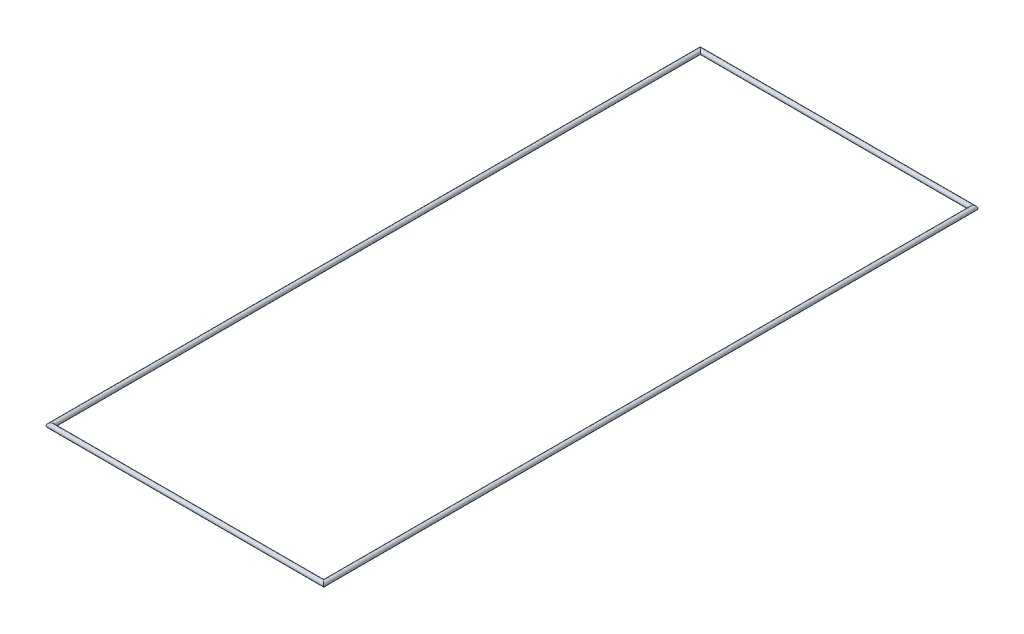
ISO-10303-21;
HEADER;
FILE_DESCRIPTION(('STEP AP214'),'2;1');
FILE_NAME('part.step','',(''),(''),'','','');
FILE_SCHEMA(('AUTOMOTIVE_DESIGN { 1 0 10303 214 1 1 1 1 }'));
ENDSEC;
DATA;
#1=APPLICATION_CONTEXT('core data for automotive mechanical design processes');
#2=APPLICATION_PROTOCOL_DEFINITION('international standard','automotive_design',2000,#1);
#3=PRODUCT_CONTEXT('',#1,'mechanical');
#4=PRODUCT('Part','Part','',(#3));
#5=PRODUCT_RELATED_PRODUCT_CATEGORY('part','',(#4));
#6=PRODUCT_DEFINITION_FORMATION('','',#4);
#7=PRODUCT_DEFINITION_CONTEXT('part definition',#1,'design');
#8=PRODUCT_DEFINITION('design','',#6,#7);
#9=PRODUCT_DEFINITION_SHAPE('','',#8);
#10=(LENGTH_UNIT() NAMED_UNIT(*) SI_UNIT(.MILLI.,.METRE.));
#11=(NAMED_UNIT(*) PLANE_ANGLE_UNIT() SI_UNIT($,.RADIAN.));
#12=(NAMED_UNIT(*) SI_UNIT($,.STERADIAN.) SOLID_ANGLE_UNIT());
#13=UNCERTAINTY_MEASURE_WITH_UNIT(LENGTH_MEASURE(1.E-05),#10,'distance_accuracy_value','');
#14=(GEOMETRIC_REPRESENTATION_CONTEXT(3) GLOBAL_UNCERTAINTY_ASSIGNED_CONTEXT((#13)) GLOBAL_UNIT_ASSIGNED_CONTEXT((#10,
#11,#12)) REPRESENTATION_CONTEXT('',''));
#15=CARTESIAN_POINT('',(0.,0.,0.));
#16=DIRECTION('',(0.,0.,1.));
#17=DIRECTION('',(1.,0.,0.));
#18=AXIS2_PLACEMENT_3D('',#15,#16,#17);
#19=CARTESIAN_POINT('',(-29.65,0.,-54.));
#20=DIRECTION('',(1.,0.,0.));
#21=DIRECTION('',(0.,0.,-1.));
#22=AXIS2_PLACEMENT_3D('',#19,#20,#21);
#23=CYLINDRICAL_SURFACE('',#22,0.5);
#24=CARTESIAN_POINT('',(-29.,0.,-54.));
#25=DIRECTION('',(0.707106781186548,0.,-0.707106781186548));
#26=DIRECTION('',(-0.707106781186548,0.,-0.707106781186548));
#27=AXIS2_PLACEMENT_3D('',#24,#25,#26);
#28=ELLIPSE('',#27,0.707106781186548,0.5);
#29=CARTESIAN_POINT('',(-29.5,0.,-54.5));
#30=VERTEX_POINT('',#29);
#31=EDGE_CURVE('E63',#30,#30,#28,.F.);
#32=ORIENTED_EDGE('',*,*,#31,.F.);
#33=EDGE_LOOP('',(#32));
#34=FACE_BOUND('',#33,.T.);
#35=CARTESIAN_POINT('',(29.,0.,-54.));
#36=DIRECTION('',(0.707106781186548,0.,0.707106781186547));
#37=DIRECTION('',(-0.707106781186547,0.,0.707106781186548));
#38=AXIS2_PLACEMENT_3D('',#35,#36,#37);
#39=ELLIPSE('',#38,0.707106781186548,0.5);
#40=CARTESIAN_POINT('',(28.5,0.,-53.5));
#41=VERTEX_POINT('',#40);
#42=EDGE_CURVE('E52',#41,#41,#39,.F.);
#43=ORIENTED_EDGE('',*,*,#42,.T.);
#44=EDGE_LOOP('',(#43));
#45=FACE_BOUND('',#44,.T.);
#46=ADVANCED_FACE('F49',(#34,#45),#23,.T.);
#47=CARTESIAN_POINT('',(29.,0.,-54.65));
#48=DIRECTION('',(0.,0.,1.));
#49=DIRECTION('',(1.,0.,0.));
#50=AXIS2_PLACEMENT_3D('',#47,#48,#49);
#51=CYLINDRICAL_SURFACE('',#50,0.5);
#52=ORIENTED_EDGE('',*,*,#42,.F.);
#53=EDGE_LOOP('',(#52));
#54=FACE_BOUND('',#53,.T.);
#55=CARTESIAN_POINT('',(29.,0.,84.));
#56=DIRECTION('',(-0.707106781186547,0.,0.707106781186548));
#57=DIRECTION('',(-0.707106781186548,0.,-0.707106781186547));
#58=AXIS2_PLACEMENT_3D('',#55,#56,#57);
#59=ELLIPSE('',#58,0.707106781186548,0.5);
#60=CARTESIAN_POINT('',(28.5,0.,83.5));
#61=VERTEX_POINT('',#60);
#62=EDGE_CURVE('E57',#61,#61,#59,.F.);
#63=ORIENTED_EDGE('',*,*,#62,.T.);
#64=EDGE_LOOP('',(#63));
#65=FACE_BOUND('',#64,.T.);
#66=ADVANCED_FACE('F74',(#54,#65),#51,.T.);
#67=CARTESIAN_POINT('',(-29.,0.,84.65));
#68=DIRECTION('',(0.,0.,-1.));
#69=DIRECTION('',(-1.,0.,0.));
#70=AXIS2_PLACEMENT_3D('',#67,#68,#69);
#71=CYLINDRICAL_SURFACE('',#70,0.5);
#72=CARTESIAN_POINT('',(-29.,0.,84.));
#73=DIRECTION('',(-0.707106781186548,0.,-0.707106781186548));
#74=DIRECTION('',(-0.707106781186548,0.,0.707106781186548));
#75=AXIS2_PLACEMENT_3D('',#72,#73,#74);
#76=ELLIPSE('',#75,0.707106781186548,0.5);
#77=CARTESIAN_POINT('',(-29.5,0.,84.5));
#78=VERTEX_POINT('',#77);
#79=EDGE_CURVE('E11',#78,#78,#76,.F.);
#80=ORIENTED_EDGE('',*,*,#79,.F.);
#81=EDGE_LOOP('',(#80));
#82=FACE_BOUND('',#81,.T.);
#83=ORIENTED_EDGE('',*,*,#31,.T.);
#84=EDGE_LOOP('',(#83));
#85=FACE_BOUND('',#84,.T.);
#86=ADVANCED_FACE('F77',(#82,#85),#71,.T.);
#87=CARTESIAN_POINT('',(29.65,0.,84.));
#88=DIRECTION('',(-1.,0.,0.));
#89=DIRECTION('',(0.,0.,1.));
#90=AXIS2_PLACEMENT_3D('',#87,#88,#89);
#91=CYLINDRICAL_SURFACE('',#90,0.5);
#92=ORIENTED_EDGE('',*,*,#62,.F.);
#93=EDGE_LOOP('',(#92));
#94=FACE_BOUND('',#93,.T.);
#95=ORIENTED_EDGE('',*,*,#79,.T.);
#96=EDGE_LOOP('',(#95));
#97=FACE_BOUND('',#96,.T.);
#98=ADVANCED_FACE('F80',(#94,#97),#91,.T.);
#99=CLOSED_SHELL('',(#46,#66,#86,#98));
#100=MANIFOLD_SOLID_BREP('B2',#99);
#101=ADVANCED_BREP_SHAPE_REPRESENTATION('',(#18,#100),#14);
#102=SHAPE_DEFINITION_REPRESENTATION(#9,#101);
ENDSEC;
END-ISO-10303-21;
